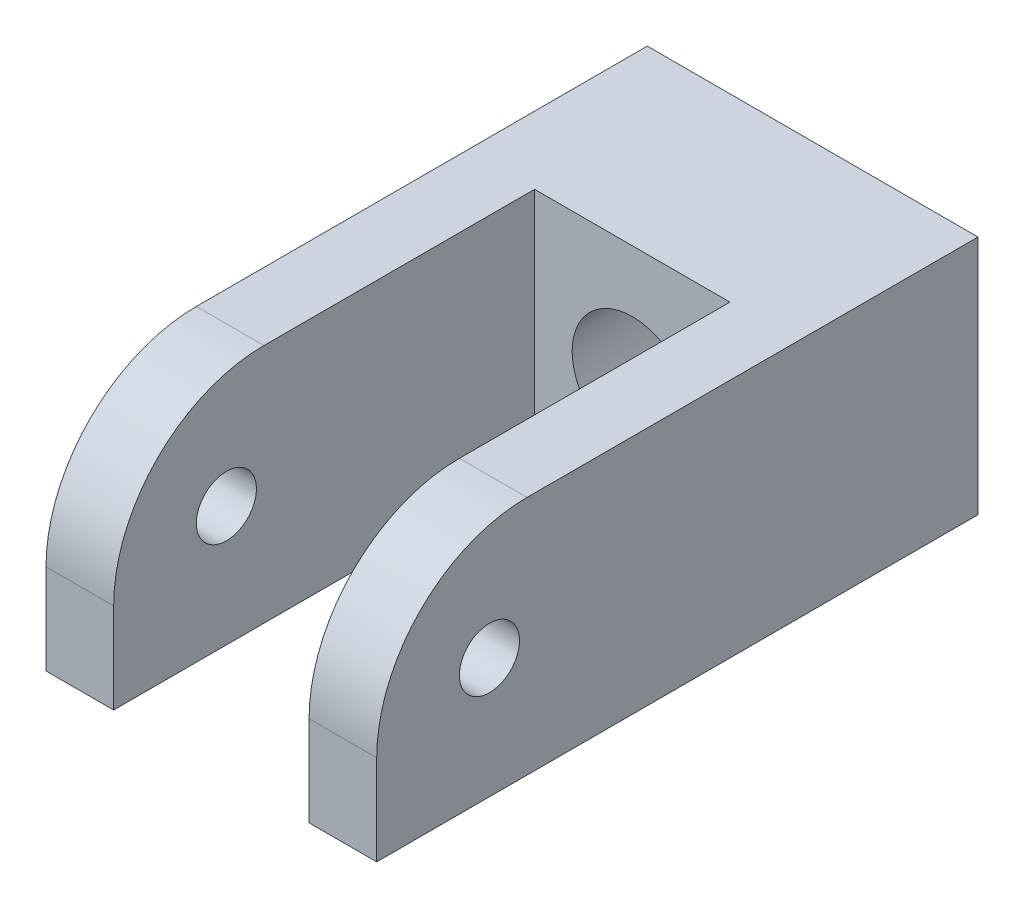
ISO-10303-21;
HEADER;
FILE_DESCRIPTION(('STEP AP214'),'2;1');
FILE_NAME('part.step','',(''),(''),'','','');
FILE_SCHEMA(('AUTOMOTIVE_DESIGN { 1 0 10303 214 1 1 1 1 }'));
ENDSEC;
DATA;
#1=APPLICATION_CONTEXT('core data for automotive mechanical design processes');
#2=APPLICATION_PROTOCOL_DEFINITION('international standard','automotive_design',2000,#1);
#3=PRODUCT_CONTEXT('',#1,'mechanical');
#4=PRODUCT('Part','Part','',(#3));
#5=PRODUCT_RELATED_PRODUCT_CATEGORY('part','',(#4));
#6=PRODUCT_DEFINITION_FORMATION('','',#4);
#7=PRODUCT_DEFINITION_CONTEXT('part definition',#1,'design');
#8=PRODUCT_DEFINITION('design','',#6,#7);
#9=PRODUCT_DEFINITION_SHAPE('','',#8);
#10=(LENGTH_UNIT() NAMED_UNIT(*) SI_UNIT(.MILLI.,.METRE.));
#11=(NAMED_UNIT(*) PLANE_ANGLE_UNIT() SI_UNIT($,.RADIAN.));
#12=(NAMED_UNIT(*) SI_UNIT($,.STERADIAN.) SOLID_ANGLE_UNIT());
#13=UNCERTAINTY_MEASURE_WITH_UNIT(LENGTH_MEASURE(1.E-05),#10,'distance_accuracy_value','');
#14=(GEOMETRIC_REPRESENTATION_CONTEXT(3) GLOBAL_UNCERTAINTY_ASSIGNED_CONTEXT((#13)) GLOBAL_UNIT_ASSIGNED_CONTEXT((#10,
#11,#12)) REPRESENTATION_CONTEXT('',''));
#15=CARTESIAN_POINT('',(0.,0.,0.));
#16=DIRECTION('',(0.,0.,1.));
#17=DIRECTION('',(1.,0.,0.));
#18=AXIS2_PLACEMENT_3D('',#15,#16,#17);
#19=CARTESIAN_POINT('',(11.,16.,-20.));
#20=DIRECTION('',(0.,0.,1.));
#21=DIRECTION('',(1.,0.,0.));
#22=AXIS2_PLACEMENT_3D('',#19,#20,#21);
#23=PLANE('',#22);
#24=CARTESIAN_POINT('',(0.,7.9208756045236,-20.));
#25=DIRECTION('',(0.,0.,-1.));
#26=DIRECTION('',(-1.,0.,0.));
#27=AXIS2_PLACEMENT_3D('',#24,#25,#26);
#28=CIRCLE('',#27,4.);
#29=CARTESIAN_POINT('',(-4.,7.9208756045236,-20.));
#30=VERTEX_POINT('',#29);
#31=EDGE_CURVE('E155',#30,#30,#28,.T.);
#32=ORIENTED_EDGE('',*,*,#31,.F.);
#33=EDGE_LOOP('',(#32));
#34=FACE_BOUND('',#33,.T.);
#35=DIRECTION('',(-1.,0.,0.));
#36=VECTOR('',#35,1.);
#37=CARTESIAN_POINT('',(11.,0.,-20.));
#38=LINE('',#37,#36);
#39=CARTESIAN_POINT('',(11.,0.,-20.));
#40=VERTEX_POINT('',#39);
#41=CARTESIAN_POINT('',(-11.,0.,-20.));
#42=VERTEX_POINT('',#41);
#43=EDGE_CURVE('E136',#40,#42,#38,.T.);
#44=ORIENTED_EDGE('',*,*,#43,.T.);
#45=DIRECTION('',(0.,-1.,0.));
#46=VECTOR('',#45,1.);
#47=CARTESIAN_POINT('',(-11.,16.,-20.));
#48=LINE('',#47,#46);
#49=CARTESIAN_POINT('',(-11.,16.,-20.));
#50=VERTEX_POINT('',#49);
#51=EDGE_CURVE('E116',#50,#42,#48,.T.);
#52=ORIENTED_EDGE('',*,*,#51,.F.);
#53=DIRECTION('',(-1.,0.,0.));
#54=VECTOR('',#53,1.);
#55=CARTESIAN_POINT('',(11.,16.,-20.));
#56=LINE('',#55,#54);
#57=CARTESIAN_POINT('',(11.,16.,-20.));
#58=VERTEX_POINT('',#57);
#59=EDGE_CURVE('E124',#58,#50,#56,.T.);
#60=ORIENTED_EDGE('',*,*,#59,.F.);
#61=DIRECTION('',(0.,-1.,0.));
#62=VECTOR('',#61,1.);
#63=CARTESIAN_POINT('',(11.,16.,-20.));
#64=LINE('',#63,#62);
#65=EDGE_CURVE('E176',#58,#40,#64,.T.);
#66=ORIENTED_EDGE('',*,*,#65,.T.);
#67=EDGE_LOOP('',(#44,#52,#60,#66));
#68=FACE_BOUND('',#67,.T.);
#69=ADVANCED_FACE('F33',(#34,#68),#23,.F.);
#70=CARTESIAN_POINT('',(-11.,16.,-20.));
#71=DIRECTION('',(1.,0.,0.));
#72=DIRECTION('',(0.,0.,-1.));
#73=AXIS2_PLACEMENT_3D('',#70,#71,#72);
#74=PLANE('',#73);
#75=CARTESIAN_POINT('',(-11.,8.,12.5));
#76=DIRECTION('',(-1.,0.,0.));
#77=DIRECTION('',(0.,0.,1.));
#78=AXIS2_PLACEMENT_3D('',#75,#76,#77);
#79=CIRCLE('',#78,2.);
#80=CARTESIAN_POINT('',(-11.,8.,14.5));
#81=VERTEX_POINT('',#80);
#82=EDGE_CURVE('E278',#81,#81,#79,.T.);
#83=ORIENTED_EDGE('',*,*,#82,.F.);
#84=EDGE_LOOP('',(#83));
#85=FACE_BOUND('',#84,.T.);
#86=DIRECTION('',(0.,-1.,0.));
#87=VECTOR('',#86,1.);
#88=CARTESIAN_POINT('',(-11.,16.,20.));
#89=LINE('',#88,#87);
#90=CARTESIAN_POINT('',(-11.,6.,20.));
#91=VERTEX_POINT('',#90);
#92=CARTESIAN_POINT('',(-11.,0.,20.));
#93=VERTEX_POINT('',#92);
#94=EDGE_CURVE('E138',#91,#93,#89,.T.);
#95=ORIENTED_EDGE('',*,*,#94,.F.);
#96=CARTESIAN_POINT('',(-11.,6.,10.));
#97=DIRECTION('',(1.,0.,0.));
#98=DIRECTION('',(0.,0.,-1.));
#99=AXIS2_PLACEMENT_3D('',#96,#97,#98);
#100=CIRCLE('',#99,10.);
#101=CARTESIAN_POINT('',(-11.,16.,10.));
#102=VERTEX_POINT('',#101);
#103=EDGE_CURVE('E119',#91,#102,#100,.F.);
#104=ORIENTED_EDGE('',*,*,#103,.T.);
#105=DIRECTION('',(0.,0.,1.));
#106=VECTOR('',#105,1.);
#107=CARTESIAN_POINT('',(-11.,16.,-20.));
#108=LINE('',#107,#106);
#109=EDGE_CURVE('E110',#50,#102,#108,.T.);
#110=ORIENTED_EDGE('',*,*,#109,.F.);
#111=ORIENTED_EDGE('',*,*,#51,.T.);
#112=DIRECTION('',(0.,0.,1.));
#113=VECTOR('',#112,1.);
#114=CARTESIAN_POINT('',(-11.,0.,-20.));
#115=LINE('',#114,#113);
#116=EDGE_CURVE('E158',#42,#93,#115,.T.);
#117=ORIENTED_EDGE('',*,*,#116,.T.);
#118=EDGE_LOOP('',(#95,#104,#110,#111,#117));
#119=FACE_BOUND('',#118,.T.);
#120=ADVANCED_FACE('F113',(#85,#119),#74,.F.);
#121=CARTESIAN_POINT('',(-11.,16.,20.));
#122=DIRECTION('',(0.,0.,-1.));
#123=DIRECTION('',(-1.,0.,0.));
#124=AXIS2_PLACEMENT_3D('',#121,#122,#123);
#125=PLANE('',#124);
#126=DIRECTION('',(0.,-1.,0.));
#127=VECTOR('',#126,1.);
#128=CARTESIAN_POINT('',(-6.5,16.,20.));
#129=LINE('',#128,#127);
#130=CARTESIAN_POINT('',(-6.5,6.,20.));
#131=VERTEX_POINT('',#130);
#132=CARTESIAN_POINT('',(-6.5,0.,20.));
#133=VERTEX_POINT('',#132);
#134=EDGE_CURVE('E142',#131,#133,#129,.T.);
#135=ORIENTED_EDGE('',*,*,#134,.F.);
#136=DIRECTION('',(1.,0.,0.));
#137=VECTOR('',#136,1.);
#138=CARTESIAN_POINT('',(-11.,6.,20.));
#139=LINE('',#138,#137);
#140=EDGE_CURVE('E149',#131,#91,#139,.F.);
#141=ORIENTED_EDGE('',*,*,#140,.T.);
#142=ORIENTED_EDGE('',*,*,#94,.T.);
#143=DIRECTION('',(1.,0.,0.));
#144=VECTOR('',#143,1.);
#145=CARTESIAN_POINT('',(-11.,0.,20.));
#146=LINE('',#145,#144);
#147=EDGE_CURVE('E179',#93,#133,#146,.T.);
#148=ORIENTED_EDGE('',*,*,#147,.T.);
#149=EDGE_LOOP('',(#135,#141,#142,#148));
#150=FACE_BOUND('',#149,.T.);
#151=ADVANCED_FACE('F212',(#150),#125,.F.);
#152=CARTESIAN_POINT('',(-6.5,16.,20.));
#153=DIRECTION('',(-1.,0.,0.));
#154=DIRECTION('',(0.,0.,1.));
#155=AXIS2_PLACEMENT_3D('',#152,#153,#154);
#156=PLANE('',#155);
#157=CARTESIAN_POINT('',(-6.5,8.,12.5));
#158=DIRECTION('',(-1.,0.,0.));
#159=DIRECTION('',(0.,0.,1.));
#160=AXIS2_PLACEMENT_3D('',#157,#158,#159);
#161=CIRCLE('',#160,2.);
#162=CARTESIAN_POINT('',(-6.5,8.,14.5));
#163=VERTEX_POINT('',#162);
#164=EDGE_CURVE('E161',#163,#163,#161,.T.);
#165=ORIENTED_EDGE('',*,*,#164,.T.);
#166=EDGE_LOOP('',(#165));
#167=FACE_BOUND('',#166,.T.);
#168=DIRECTION('',(0.,0.,-1.));
#169=VECTOR('',#168,1.);
#170=CARTESIAN_POINT('',(-6.5,16.,20.));
#171=LINE('',#170,#169);
#172=CARTESIAN_POINT('',(-6.5,16.,10.));
#173=VERTEX_POINT('',#172);
#174=CARTESIAN_POINT('',(-6.5,16.,-7.99999999999999));
#175=VERTEX_POINT('',#174);
#176=EDGE_CURVE('E123',#173,#175,#171,.T.);
#177=ORIENTED_EDGE('',*,*,#176,.F.);
#178=CARTESIAN_POINT('',(-6.5,6.,10.));
#179=DIRECTION('',(-1.,0.,0.));
#180=DIRECTION('',(0.,0.,1.));
#181=AXIS2_PLACEMENT_3D('',#178,#179,#180);
#182=CIRCLE('',#181,10.);
#183=EDGE_CURVE('E147',#173,#131,#182,.F.);
#184=ORIENTED_EDGE('',*,*,#183,.T.);
#185=ORIENTED_EDGE('',*,*,#134,.T.);
#186=DIRECTION('',(0.,0.,-1.));
#187=VECTOR('',#186,1.);
#188=CARTESIAN_POINT('',(-6.5,0.,20.));
#189=LINE('',#188,#187);
#190=CARTESIAN_POINT('',(-6.5,0.,-7.99999999999999));
#191=VERTEX_POINT('',#190);
#192=EDGE_CURVE('E182',#133,#191,#189,.T.);
#193=ORIENTED_EDGE('',*,*,#192,.T.);
#194=DIRECTION('',(0.,-1.,0.));
#195=VECTOR('',#194,1.);
#196=CARTESIAN_POINT('',(-6.5,16.,-7.99999999999999));
#197=LINE('',#196,#195);
#198=EDGE_CURVE('E201',#175,#191,#197,.T.);
#199=ORIENTED_EDGE('',*,*,#198,.F.);
#200=EDGE_LOOP('',(#177,#184,#185,#193,#199));
#201=FACE_BOUND('',#200,.T.);
#202=ADVANCED_FACE('F206',(#167,#201),#156,.F.);
#203=CARTESIAN_POINT('',(-6.5,16.,-7.99999999999999));
#204=DIRECTION('',(0.,0.,-1.));
#205=DIRECTION('',(-1.,0.,0.));
#206=AXIS2_PLACEMENT_3D('',#203,#204,#205);
#207=PLANE('',#206);
#208=CARTESIAN_POINT('',(0.,7.9208756045236,-7.99999999999999));
#209=DIRECTION('',(0.,0.,-1.));
#210=DIRECTION('',(-1.,0.,0.));
#211=AXIS2_PLACEMENT_3D('',#208,#209,#210);
#212=CIRCLE('',#211,4.);
#213=CARTESIAN_POINT('',(-4.00000000000001,7.9208756045236,-7.99999999999999));
#214=VERTEX_POINT('',#213);
#215=EDGE_CURVE('E153',#214,#214,#212,.T.);
#216=ORIENTED_EDGE('',*,*,#215,.T.);
#217=EDGE_LOOP('',(#216));
#218=FACE_BOUND('',#217,.T.);
#219=DIRECTION('',(1.,0.,0.));
#220=VECTOR('',#219,1.);
#221=CARTESIAN_POINT('',(-6.5,0.,-7.99999999999999));
#222=LINE('',#221,#220);
#223=CARTESIAN_POINT('',(6.5,0.,-7.99999999999999));
#224=VERTEX_POINT('',#223);
#225=EDGE_CURVE('E184',#191,#224,#222,.T.);
#226=ORIENTED_EDGE('',*,*,#225,.T.);
#227=DIRECTION('',(0.,-1.,0.));
#228=VECTOR('',#227,1.);
#229=CARTESIAN_POINT('',(6.5,16.,-7.99999999999999));
#230=LINE('',#229,#228);
#231=CARTESIAN_POINT('',(6.5,16.,-7.99999999999999));
#232=VERTEX_POINT('',#231);
#233=EDGE_CURVE('E198',#232,#224,#230,.T.);
#234=ORIENTED_EDGE('',*,*,#233,.F.);
#235=DIRECTION('',(1.,0.,0.));
#236=VECTOR('',#235,1.);
#237=CARTESIAN_POINT('',(-6.5,16.,-7.99999999999999));
#238=LINE('',#237,#236);
#239=EDGE_CURVE('E171',#175,#232,#238,.T.);
#240=ORIENTED_EDGE('',*,*,#239,.F.);
#241=ORIENTED_EDGE('',*,*,#198,.T.);
#242=EDGE_LOOP('',(#226,#234,#240,#241));
#243=FACE_BOUND('',#242,.T.);
#244=ADVANCED_FACE('F220',(#218,#243),#207,.F.);
#245=CARTESIAN_POINT('',(6.5,16.,-7.99999999999999));
#246=DIRECTION('',(1.,0.,0.));
#247=DIRECTION('',(0.,0.,-1.));
#248=AXIS2_PLACEMENT_3D('',#245,#246,#247);
#249=PLANE('',#248);
#250=CARTESIAN_POINT('',(6.5,8.,12.5));
#251=DIRECTION('',(1.,0.,0.));
#252=DIRECTION('',(0.,0.,-1.));
#253=AXIS2_PLACEMENT_3D('',#250,#251,#252);
#254=CIRCLE('',#253,2.);
#255=CARTESIAN_POINT('',(6.5,8.,10.5));
#256=VERTEX_POINT('',#255);
#257=EDGE_CURVE('E166',#256,#256,#254,.T.);
#258=ORIENTED_EDGE('',*,*,#257,.T.);
#259=EDGE_LOOP('',(#258));
#260=FACE_BOUND('',#259,.T.);
#261=DIRECTION('',(0.,-1.,0.));
#262=VECTOR('',#261,1.);
#263=CARTESIAN_POINT('',(6.5,16.,20.));
#264=LINE('',#263,#262);
#265=CARTESIAN_POINT('',(6.5,6.,20.));
#266=VERTEX_POINT('',#265);
#267=CARTESIAN_POINT('',(6.5,0.,20.));
#268=VERTEX_POINT('',#267);
#269=EDGE_CURVE('E196',#266,#268,#264,.T.);
#270=ORIENTED_EDGE('',*,*,#269,.F.);
#271=CARTESIAN_POINT('',(6.5,6.,10.));
#272=DIRECTION('',(1.,0.,0.));
#273=DIRECTION('',(0.,0.,-1.));
#274=AXIS2_PLACEMENT_3D('',#271,#272,#273);
#275=CIRCLE('',#274,10.);
#276=CARTESIAN_POINT('',(6.5,16.,10.));
#277=VERTEX_POINT('',#276);
#278=EDGE_CURVE('E11',#266,#277,#275,.F.);
#279=ORIENTED_EDGE('',*,*,#278,.T.);
#280=DIRECTION('',(0.,0.,1.));
#281=VECTOR('',#280,1.);
#282=CARTESIAN_POINT('',(6.5,16.,-7.99999999999999));
#283=LINE('',#282,#281);
#284=EDGE_CURVE('E173',#232,#277,#283,.T.);
#285=ORIENTED_EDGE('',*,*,#284,.F.);
#286=ORIENTED_EDGE('',*,*,#233,.T.);
#287=DIRECTION('',(0.,0.,1.));
#288=VECTOR('',#287,1.);
#289=CARTESIAN_POINT('',(6.5,0.,-7.99999999999999));
#290=LINE('',#289,#288);
#291=EDGE_CURVE('E186',#224,#268,#290,.T.);
#292=ORIENTED_EDGE('',*,*,#291,.T.);
#293=EDGE_LOOP('',(#270,#279,#285,#286,#292));
#294=FACE_BOUND('',#293,.T.);
#295=ADVANCED_FACE('F224',(#260,#294),#249,.F.);
#296=CARTESIAN_POINT('',(6.5,16.,20.));
#297=DIRECTION('',(0.,0.,-1.));
#298=DIRECTION('',(-1.,0.,0.));
#299=AXIS2_PLACEMENT_3D('',#296,#297,#298);
#300=PLANE('',#299);
#301=DIRECTION('',(0.,-1.,0.));
#302=VECTOR('',#301,1.);
#303=CARTESIAN_POINT('',(11.,16.,20.));
#304=LINE('',#303,#302);
#305=CARTESIAN_POINT('',(11.,6.,20.));
#306=VERTEX_POINT('',#305);
#307=CARTESIAN_POINT('',(11.,0.,20.));
#308=VERTEX_POINT('',#307);
#309=EDGE_CURVE('E194',#306,#308,#304,.T.);
#310=ORIENTED_EDGE('',*,*,#309,.F.);
#311=DIRECTION('',(1.,0.,0.));
#312=VECTOR('',#311,1.);
#313=CARTESIAN_POINT('',(6.5,6.,20.));
#314=LINE('',#313,#312);
#315=EDGE_CURVE('E42',#306,#266,#314,.F.);
#316=ORIENTED_EDGE('',*,*,#315,.T.);
#317=ORIENTED_EDGE('',*,*,#269,.T.);
#318=DIRECTION('',(1.,0.,0.));
#319=VECTOR('',#318,1.);
#320=CARTESIAN_POINT('',(6.5,0.,20.));
#321=LINE('',#320,#319);
#322=EDGE_CURVE('E189',#268,#308,#321,.T.);
#323=ORIENTED_EDGE('',*,*,#322,.T.);
#324=EDGE_LOOP('',(#310,#316,#317,#323));
#325=FACE_BOUND('',#324,.T.);
#326=ADVANCED_FACE('F256',(#325),#300,.F.);
#327=CARTESIAN_POINT('',(11.,16.,20.));
#328=DIRECTION('',(-1.,0.,0.));
#329=DIRECTION('',(0.,0.,1.));
#330=AXIS2_PLACEMENT_3D('',#327,#328,#329);
#331=PLANE('',#330);
#332=CARTESIAN_POINT('',(11.,8.,12.5));
#333=DIRECTION('',(-1.,0.,0.));
#334=DIRECTION('',(0.,0.,1.));
#335=AXIS2_PLACEMENT_3D('',#332,#333,#334);
#336=CIRCLE('',#335,2.);
#337=CARTESIAN_POINT('',(11.,8.,14.5));
#338=VERTEX_POINT('',#337);
#339=EDGE_CURVE('E37',#338,#338,#336,.T.);
#340=ORIENTED_EDGE('',*,*,#339,.T.);
#341=EDGE_LOOP('',(#340));
#342=FACE_BOUND('',#341,.T.);
#343=DIRECTION('',(0.,0.,-1.));
#344=VECTOR('',#343,1.);
#345=CARTESIAN_POINT('',(11.,16.,20.));
#346=LINE('',#345,#344);
#347=CARTESIAN_POINT('',(11.,16.,10.));
#348=VERTEX_POINT('',#347);
#349=EDGE_CURVE('E129',#348,#58,#346,.T.);
#350=ORIENTED_EDGE('',*,*,#349,.F.);
#351=CARTESIAN_POINT('',(11.,6.,10.));
#352=DIRECTION('',(-1.,0.,0.));
#353=DIRECTION('',(0.,0.,1.));
#354=AXIS2_PLACEMENT_3D('',#351,#352,#353);
#355=CIRCLE('',#354,10.);
#356=EDGE_CURVE('E57',#348,#306,#355,.F.);
#357=ORIENTED_EDGE('',*,*,#356,.T.);
#358=ORIENTED_EDGE('',*,*,#309,.T.);
#359=DIRECTION('',(0.,0.,-1.));
#360=VECTOR('',#359,1.);
#361=CARTESIAN_POINT('',(11.,0.,20.));
#362=LINE('',#361,#360);
#363=EDGE_CURVE('E133',#308,#40,#362,.T.);
#364=ORIENTED_EDGE('',*,*,#363,.T.);
#365=ORIENTED_EDGE('',*,*,#65,.F.);
#366=EDGE_LOOP('',(#350,#357,#358,#364,#365));
#367=FACE_BOUND('',#366,.T.);
#368=ADVANCED_FACE('F260',(#342,#367),#331,.F.);
#369=CARTESIAN_POINT('',(0.,16.,0.));
#370=DIRECTION('',(0.,1.,0.));
#371=DIRECTION('',(0.,0.,1.));
#372=AXIS2_PLACEMENT_3D('',#369,#370,#371);
#373=PLANE('',#372);
#374=ORIENTED_EDGE('',*,*,#109,.T.);
#375=DIRECTION('',(1.,0.,0.));
#376=VECTOR('',#375,1.);
#377=CARTESIAN_POINT('',(-6.5,16.,10.));
#378=LINE('',#377,#376);
#379=EDGE_CURVE('E140',#102,#173,#378,.T.);
#380=ORIENTED_EDGE('',*,*,#379,.T.);
#381=ORIENTED_EDGE('',*,*,#176,.T.);
#382=ORIENTED_EDGE('',*,*,#239,.T.);
#383=ORIENTED_EDGE('',*,*,#284,.T.);
#384=DIRECTION('',(1.,0.,0.));
#385=VECTOR('',#384,1.);
#386=CARTESIAN_POINT('',(11.,16.,10.));
#387=LINE('',#386,#385);
#388=EDGE_CURVE('E137',#277,#348,#387,.T.);
#389=ORIENTED_EDGE('',*,*,#388,.T.);
#390=ORIENTED_EDGE('',*,*,#349,.T.);
#391=ORIENTED_EDGE('',*,*,#59,.T.);
#392=EDGE_LOOP('',(#374,#380,#381,#382,#383,#389,#390,#391));
#393=FACE_BOUND('',#392,.T.);
#394=ADVANCED_FACE('F127',(#393),#373,.T.);
#395=CARTESIAN_POINT('',(0.,0.,0.));
#396=DIRECTION('',(0.,1.,0.));
#397=DIRECTION('',(0.,0.,1.));
#398=AXIS2_PLACEMENT_3D('',#395,#396,#397);
#399=PLANE('',#398);
#400=ORIENTED_EDGE('',*,*,#43,.F.);
#401=ORIENTED_EDGE('',*,*,#363,.F.);
#402=ORIENTED_EDGE('',*,*,#322,.F.);
#403=ORIENTED_EDGE('',*,*,#291,.F.);
#404=ORIENTED_EDGE('',*,*,#225,.F.);
#405=ORIENTED_EDGE('',*,*,#192,.F.);
#406=ORIENTED_EDGE('',*,*,#147,.F.);
#407=ORIENTED_EDGE('',*,*,#116,.F.);
#408=EDGE_LOOP('',(#400,#401,#402,#403,#404,#405,#406,#407));
#409=FACE_BOUND('',#408,.T.);
#410=ADVANCED_FACE('F215',(#409),#399,.F.);
#411=CARTESIAN_POINT('',(0.,6.,10.));
#412=DIRECTION('',(-1.,0.,0.));
#413=DIRECTION('',(0.,0.,1.));
#414=AXIS2_PLACEMENT_3D('',#411,#412,#413);
#415=CYLINDRICAL_SURFACE('',#414,10.);
#416=ORIENTED_EDGE('',*,*,#103,.F.);
#417=ORIENTED_EDGE('',*,*,#140,.F.);
#418=ORIENTED_EDGE('',*,*,#183,.F.);
#419=ORIENTED_EDGE('',*,*,#379,.F.);
#420=EDGE_LOOP('',(#416,#417,#418,#419));
#421=FACE_BOUND('',#420,.T.);
#422=ADVANCED_FACE('F230',(#421),#415,.T.);
#423=CARTESIAN_POINT('',(0.,6.,10.));
#424=DIRECTION('',(-1.,0.,0.));
#425=DIRECTION('',(0.,0.,1.));
#426=AXIS2_PLACEMENT_3D('',#423,#424,#425);
#427=CYLINDRICAL_SURFACE('',#426,10.);
#428=ORIENTED_EDGE('',*,*,#278,.F.);
#429=ORIENTED_EDGE('',*,*,#315,.F.);
#430=ORIENTED_EDGE('',*,*,#356,.F.);
#431=ORIENTED_EDGE('',*,*,#388,.F.);
#432=EDGE_LOOP('',(#428,#429,#430,#431));
#433=FACE_BOUND('',#432,.T.);
#434=ADVANCED_FACE('F35',(#433),#427,.T.);
#435=CARTESIAN_POINT('',(0.,7.9208756045236,-4.));
#436=DIRECTION('',(0.,0.,-1.));
#437=DIRECTION('',(-1.,0.,0.));
#438=AXIS2_PLACEMENT_3D('',#435,#436,#437);
#439=CYLINDRICAL_SURFACE('',#438,4.);
#440=ORIENTED_EDGE('',*,*,#31,.T.);
#441=EDGE_LOOP('',(#440));
#442=FACE_BOUND('',#441,.T.);
#443=ORIENTED_EDGE('',*,*,#215,.F.);
#444=EDGE_LOOP('',(#443));
#445=FACE_BOUND('',#444,.T.);
#446=ADVANCED_FACE('F229',(#442,#445),#439,.F.);
#447=CARTESIAN_POINT('',(13.,8.,12.5));
#448=DIRECTION('',(-1.,0.,0.));
#449=DIRECTION('',(0.,0.,1.));
#450=AXIS2_PLACEMENT_3D('',#447,#448,#449);
#451=CYLINDRICAL_SURFACE('',#450,2.);
#452=ORIENTED_EDGE('',*,*,#339,.F.);
#453=EDGE_LOOP('',(#452));
#454=FACE_BOUND('',#453,.T.);
#455=ORIENTED_EDGE('',*,*,#257,.F.);
#456=EDGE_LOOP('',(#455));
#457=FACE_BOUND('',#456,.T.);
#458=ADVANCED_FACE('F235',(#454,#457),#451,.F.);
#459=ORIENTED_EDGE('',*,*,#82,.T.);
#460=EDGE_LOOP('',(#459));
#461=FACE_BOUND('',#460,.T.);
#462=ORIENTED_EDGE('',*,*,#164,.F.);
#463=EDGE_LOOP('',(#462));
#464=FACE_BOUND('',#463,.T.);
#465=ADVANCED_FACE('F268',(#461,#464),#451,.F.);
#466=CLOSED_SHELL('',(#69,#120,#151,#202,#244,#295,#326,#368,#394,#410,#422,#434,#446,#458,#465));
#467=MANIFOLD_SOLID_BREP('B2',#466);
#468=ADVANCED_BREP_SHAPE_REPRESENTATION('',(#18,#467),#14);
#469=SHAPE_DEFINITION_REPRESENTATION(#9,#468);
ENDSEC;
END-ISO-10303-21;
